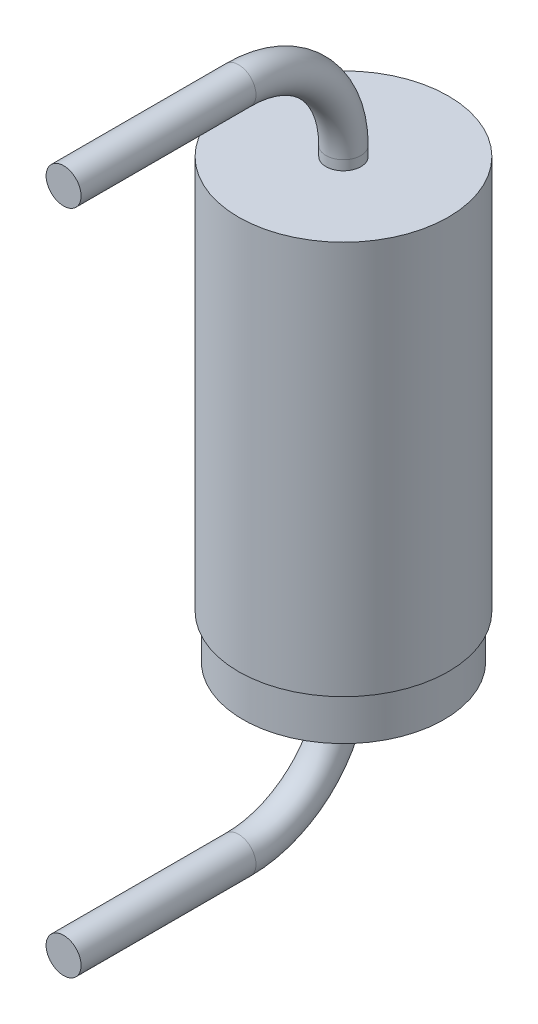
ISO-10303-21;
HEADER;
FILE_DESCRIPTION(('STEP AP214'),'2;1');
FILE_NAME('part.step','',(''),(''),'','','');
FILE_SCHEMA(('AUTOMOTIVE_DESIGN { 1 0 10303 214 1 1 1 1 }'));
ENDSEC;
DATA;
#1=APPLICATION_CONTEXT('core data for automotive mechanical design processes');
#2=APPLICATION_PROTOCOL_DEFINITION('international standard','automotive_design',2000,#1);
#3=PRODUCT_CONTEXT('',#1,'mechanical');
#4=PRODUCT('Part','Part','',(#3));
#5=PRODUCT_RELATED_PRODUCT_CATEGORY('part','',(#4));
#6=PRODUCT_DEFINITION_FORMATION('','',#4);
#7=PRODUCT_DEFINITION_CONTEXT('part definition',#1,'design');
#8=PRODUCT_DEFINITION('design','',#6,#7);
#9=PRODUCT_DEFINITION_SHAPE('','',#8);
#10=(LENGTH_UNIT() NAMED_UNIT(*) SI_UNIT(.MILLI.,.METRE.));
#11=(NAMED_UNIT(*) PLANE_ANGLE_UNIT() SI_UNIT($,.RADIAN.));
#12=(NAMED_UNIT(*) SI_UNIT($,.STERADIAN.) SOLID_ANGLE_UNIT());
#13=UNCERTAINTY_MEASURE_WITH_UNIT(LENGTH_MEASURE(1.E-05),#10,'distance_accuracy_value','');
#14=(GEOMETRIC_REPRESENTATION_CONTEXT(3) GLOBAL_UNCERTAINTY_ASSIGNED_CONTEXT((#13)) GLOBAL_UNIT_ASSIGNED_CONTEXT((#10,
#11,#12)) REPRESENTATION_CONTEXT('',''));
#15=CARTESIAN_POINT('',(0.,0.,0.));
#16=DIRECTION('',(0.,0.,1.));
#17=DIRECTION('',(1.,0.,0.));
#18=AXIS2_PLACEMENT_3D('',#15,#16,#17);
#19=CARTESIAN_POINT('',(0.,-2.5,0.));
#20=DIRECTION('',(0.,1.,0.));
#21=DIRECTION('',(0.,0.,1.));
#22=AXIS2_PLACEMENT_3D('',#19,#20,#21);
#23=CYLINDRICAL_SURFACE('',#22,1.2);
#24=CARTESIAN_POINT('',(0.,2.5,0.));
#25=DIRECTION('',(0.,1.,0.));
#26=DIRECTION('',(0.,0.,1.));
#27=AXIS2_PLACEMENT_3D('',#24,#25,#26);
#28=CIRCLE('',#27,1.2);
#29=CARTESIAN_POINT('',(0.,2.5,1.2));
#30=VERTEX_POINT('',#29);
#31=EDGE_CURVE('E11',#30,#30,#28,.T.);
#32=ORIENTED_EDGE('',*,*,#31,.F.);
#33=EDGE_LOOP('',(#32));
#34=FACE_BOUND('',#33,.T.);
#35=CARTESIAN_POINT('',(0.,-2.,0.));
#36=DIRECTION('',(0.,-1.,0.));
#37=DIRECTION('',(0.,0.,-1.));
#38=AXIS2_PLACEMENT_3D('',#35,#36,#37);
#39=CIRCLE('',#38,1.2);
#40=CARTESIAN_POINT('',(0.,-2.,-1.2));
#41=VERTEX_POINT('',#40);
#42=EDGE_CURVE('E117',#41,#41,#39,.T.);
#43=ORIENTED_EDGE('',*,*,#42,.F.);
#44=EDGE_LOOP('',(#43));
#45=FACE_BOUND('',#44,.T.);
#46=ADVANCED_FACE('F74',(#34,#45),#23,.T.);
#47=CARTESIAN_POINT('',(0.,2.5,0.));
#48=DIRECTION('',(0.,1.,0.));
#49=DIRECTION('',(0.,0.,1.));
#50=AXIS2_PLACEMENT_3D('',#47,#48,#49);
#51=PLANE('',#50);
#52=CARTESIAN_POINT('',(0.,2.5,0.));
#53=DIRECTION('',(0.,-1.,0.));
#54=DIRECTION('',(0.,0.,-1.));
#55=AXIS2_PLACEMENT_3D('',#52,#53,#54);
#56=CIRCLE('',#55,0.2);
#57=CARTESIAN_POINT('',(0.,2.5,-0.2));
#58=VERTEX_POINT('',#57);
#59=EDGE_CURVE('E97',#58,#58,#56,.T.);
#60=ORIENTED_EDGE('',*,*,#59,.T.);
#61=EDGE_LOOP('',(#60));
#62=FACE_BOUND('',#61,.T.);
#63=ORIENTED_EDGE('',*,*,#31,.T.);
#64=EDGE_LOOP('',(#63));
#65=FACE_BOUND('',#64,.T.);
#66=ADVANCED_FACE('F142',(#62,#65),#51,.T.);
#67=CARTESIAN_POINT('',(0.,3.81,3.2));
#68=DIRECTION('',(0.,0.,-1.));
#69=DIRECTION('',(0.,1.,0.));
#70=AXIS2_PLACEMENT_3D('',#67,#68,#69);
#71=PLANE('',#70);
#72=CARTESIAN_POINT('',(0.,3.81,3.2));
#73=DIRECTION('',(0.,0.,-1.));
#74=DIRECTION('',(0.,1.,0.));
#75=AXIS2_PLACEMENT_3D('',#72,#73,#74);
#76=CIRCLE('',#75,0.2);
#77=CARTESIAN_POINT('',(0.,4.01,3.2));
#78=VERTEX_POINT('',#77);
#79=EDGE_CURVE('E81',#78,#78,#76,.T.);
#80=ORIENTED_EDGE('',*,*,#79,.F.);
#81=EDGE_LOOP('',(#80));
#82=FACE_BOUND('',#81,.T.);
#83=ADVANCED_FACE('F138',(#82),#71,.F.);
#84=CARTESIAN_POINT('',(0.,2.5,0.));
#85=DIRECTION('',(0.,1.,0.));
#86=DIRECTION('',(0.,0.,1.));
#87=AXIS2_PLACEMENT_3D('',#84,#85,#86);
#88=CYLINDRICAL_SURFACE('',#87,0.2);
#89=CARTESIAN_POINT('',(0.,2.61,0.));
#90=DIRECTION('',(0.,-1.,0.));
#91=DIRECTION('',(0.,0.,-1.));
#92=AXIS2_PLACEMENT_3D('',#89,#90,#91);
#93=CIRCLE('',#92,0.2);
#94=CARTESIAN_POINT('',(0.,2.61,-0.2));
#95=VERTEX_POINT('',#94);
#96=EDGE_CURVE('E91',#95,#95,#93,.T.);
#97=ORIENTED_EDGE('',*,*,#96,.T.);
#98=EDGE_LOOP('',(#97));
#99=FACE_BOUND('',#98,.T.);
#100=ORIENTED_EDGE('',*,*,#59,.F.);
#101=EDGE_LOOP('',(#100));
#102=FACE_BOUND('',#101,.T.);
#103=ADVANCED_FACE('F153',(#99,#102),#88,.T.);
#104=CARTESIAN_POINT('',(0.,2.61,1.2));
#105=DIRECTION('',(1.,0.,0.));
#106=DIRECTION('',(0.,0.,-1.));
#107=AXIS2_PLACEMENT_3D('',#104,#105,#106);
#108=TOROIDAL_SURFACE('',#107,1.2,0.2);
#109=CARTESIAN_POINT('',(0.,3.81,1.2));
#110=DIRECTION('',(0.,0.,-1.));
#111=DIRECTION('',(0.,1.,0.));
#112=AXIS2_PLACEMENT_3D('',#109,#110,#111);
#113=CIRCLE('',#112,0.2);
#114=CARTESIAN_POINT('',(0.,4.01,1.2));
#115=VERTEX_POINT('',#114);
#116=EDGE_CURVE('E86',#115,#115,#113,.T.);
#117=CARTESIAN_POINT('',(0.,2.61,1.2));
#118=DIRECTION('',(1.,0.,0.));
#119=DIRECTION('',(0.,0.,-1.));
#120=AXIS2_PLACEMENT_3D('',#117,#118,#119);
#121=CIRCLE('',#120,1.4);
#122=EDGE_CURVE('',#95,#115,#121,.T.);
#123=ORIENTED_EDGE('',*,*,#96,.F.);
#124=ORIENTED_EDGE('',*,*,#116,.T.);
#125=ORIENTED_EDGE('',*,*,#122,.T.);
#126=ORIENTED_EDGE('',*,*,#122,.F.);
#127=EDGE_LOOP('',(#123,#125,#124,#126));
#128=FACE_BOUND('',#127,.T.);
#129=ADVANCED_FACE('F157',(#128),#108,.T.);
#130=CARTESIAN_POINT('',(0.,3.81,1.2));
#131=DIRECTION('',(0.,0.,1.));
#132=DIRECTION('',(0.,-1.,0.));
#133=AXIS2_PLACEMENT_3D('',#130,#131,#132);
#134=CYLINDRICAL_SURFACE('',#133,0.2);
#135=ORIENTED_EDGE('',*,*,#79,.T.);
#136=EDGE_LOOP('',(#135));
#137=FACE_BOUND('',#136,.T.);
#138=ORIENTED_EDGE('',*,*,#116,.F.);
#139=EDGE_LOOP('',(#138));
#140=FACE_BOUND('',#139,.T.);
#141=ADVANCED_FACE('F136',(#137,#140),#134,.T.);
#142=CARTESIAN_POINT('',(0.,-2.,0.));
#143=DIRECTION('',(0.,-1.,0.));
#144=DIRECTION('',(0.,0.,-1.));
#145=AXIS2_PLACEMENT_3D('',#142,#143,#144);
#146=PLANE('',#145);
#147=CARTESIAN_POINT('',(0.,-2.,0.));
#148=DIRECTION('',(0.,-1.,0.));
#149=DIRECTION('',(0.,0.,-1.));
#150=AXIS2_PLACEMENT_3D('',#147,#148,#149);
#151=CIRCLE('',#150,1.15);
#152=CARTESIAN_POINT('',(0.,-2.,-1.15));
#153=VERTEX_POINT('',#152);
#154=EDGE_CURVE('E121',#153,#153,#151,.T.);
#155=ORIENTED_EDGE('',*,*,#154,.F.);
#156=EDGE_LOOP('',(#155));
#157=FACE_BOUND('',#156,.T.);
#158=ORIENTED_EDGE('',*,*,#42,.T.);
#159=EDGE_LOOP('',(#158));
#160=FACE_BOUND('',#159,.T.);
#161=ADVANCED_FACE('F133',(#157,#160),#146,.T.);
#162=CARTESIAN_POINT('',(0.,-2.,0.));
#163=DIRECTION('',(0.,-1.,0.));
#164=DIRECTION('',(0.,0.,-1.));
#165=AXIS2_PLACEMENT_3D('',#162,#163,#164);
#166=CYLINDRICAL_SURFACE('',#165,1.15);
#167=ORIENTED_EDGE('',*,*,#154,.T.);
#168=EDGE_LOOP('',(#167));
#169=FACE_BOUND('',#168,.T.);
#170=CARTESIAN_POINT('',(0.,-2.5,0.));
#171=DIRECTION('',(0.,-1.,0.));
#172=DIRECTION('',(0.,0.,-1.));
#173=AXIS2_PLACEMENT_3D('',#170,#171,#172);
#174=CIRCLE('',#173,1.15);
#175=CARTESIAN_POINT('',(0.,-2.5,-1.15));
#176=VERTEX_POINT('',#175);
#177=EDGE_CURVE('E122',#176,#176,#174,.T.);
#178=ORIENTED_EDGE('',*,*,#177,.F.);
#179=EDGE_LOOP('',(#178));
#180=FACE_BOUND('',#179,.T.);
#181=ADVANCED_FACE('F130',(#169,#180),#166,.T.);
#182=CARTESIAN_POINT('',(0.,-3.81,3.2));
#183=DIRECTION('',(0.,0.,-1.));
#184=DIRECTION('',(0.,-1.,0.));
#185=AXIS2_PLACEMENT_3D('',#182,#183,#184);
#186=PLANE('',#185);
#187=CARTESIAN_POINT('',(0.,-3.81,3.2));
#188=DIRECTION('',(0.,0.,1.));
#189=DIRECTION('',(0.,-1.,0.));
#190=AXIS2_PLACEMENT_3D('',#187,#188,#189);
#191=CIRCLE('',#190,0.2);
#192=CARTESIAN_POINT('',(0.,-4.01,3.2));
#193=VERTEX_POINT('',#192);
#194=EDGE_CURVE('E101',#193,#193,#191,.F.);
#195=ORIENTED_EDGE('',*,*,#194,.F.);
#196=EDGE_LOOP('',(#195));
#197=FACE_BOUND('',#196,.T.);
#198=ADVANCED_FACE('F170',(#197),#186,.F.);
#199=CARTESIAN_POINT('',(0.,-3.81,1.2));
#200=DIRECTION('',(0.,0.,1.));
#201=DIRECTION('',(0.,-1.,0.));
#202=AXIS2_PLACEMENT_3D('',#199,#200,#201);
#203=CYLINDRICAL_SURFACE('',#202,0.2);
#204=ORIENTED_EDGE('',*,*,#194,.T.);
#205=EDGE_LOOP('',(#204));
#206=FACE_BOUND('',#205,.T.);
#207=CARTESIAN_POINT('',(0.,-3.81,1.2));
#208=DIRECTION('',(0.,0.,1.));
#209=DIRECTION('',(0.,-1.,0.));
#210=AXIS2_PLACEMENT_3D('',#207,#208,#209);
#211=CIRCLE('',#210,0.2);
#212=CARTESIAN_POINT('',(0.,-4.01,1.2));
#213=VERTEX_POINT('',#212);
#214=EDGE_CURVE('E105',#213,#213,#211,.F.);
#215=ORIENTED_EDGE('',*,*,#214,.F.);
#216=EDGE_LOOP('',(#215));
#217=FACE_BOUND('',#216,.T.);
#218=ADVANCED_FACE('F172',(#206,#217),#203,.T.);
#219=CARTESIAN_POINT('',(0.,-2.61,1.2));
#220=DIRECTION('',(-1.,0.,0.));
#221=DIRECTION('',(0.,0.,1.));
#222=AXIS2_PLACEMENT_3D('',#219,#220,#221);
#223=TOROIDAL_SURFACE('',#222,1.2,0.2);
#224=CARTESIAN_POINT('',(0.,-2.61,0.));
#225=DIRECTION('',(0.,-1.,0.));
#226=DIRECTION('',(0.,0.,-1.));
#227=AXIS2_PLACEMENT_3D('',#224,#225,#226);
#228=CIRCLE('',#227,0.2);
#229=CARTESIAN_POINT('',(0.,-2.61,-0.2));
#230=VERTEX_POINT('',#229);
#231=EDGE_CURVE('E109',#230,#230,#228,.F.);
#232=CARTESIAN_POINT('',(0.,-2.61,1.2));
#233=DIRECTION('',(-1.,0.,0.));
#234=DIRECTION('',(0.,0.,1.));
#235=AXIS2_PLACEMENT_3D('',#232,#233,#234);
#236=CIRCLE('',#235,1.4);
#237=EDGE_CURVE('',#230,#213,#236,.T.);
#238=ORIENTED_EDGE('',*,*,#231,.F.);
#239=ORIENTED_EDGE('',*,*,#214,.T.);
#240=ORIENTED_EDGE('',*,*,#237,.T.);
#241=ORIENTED_EDGE('',*,*,#237,.F.);
#242=EDGE_LOOP('',(#238,#240,#239,#241));
#243=FACE_BOUND('',#242,.T.);
#244=ADVANCED_FACE('F175',(#243),#223,.T.);
#245=CARTESIAN_POINT('',(0.,-2.5,0.));
#246=DIRECTION('',(0.,-1.,0.));
#247=DIRECTION('',(0.,0.,-1.));
#248=AXIS2_PLACEMENT_3D('',#245,#246,#247);
#249=CYLINDRICAL_SURFACE('',#248,0.2);
#250=ORIENTED_EDGE('',*,*,#231,.T.);
#251=EDGE_LOOP('',(#250));
#252=FACE_BOUND('',#251,.T.);
#253=CARTESIAN_POINT('',(0.,-2.5,0.));
#254=DIRECTION('',(0.,-1.,0.));
#255=DIRECTION('',(0.,0.,-1.));
#256=AXIS2_PLACEMENT_3D('',#253,#254,#255);
#257=CIRCLE('',#256,0.2);
#258=CARTESIAN_POINT('',(0.,-2.5,-0.2));
#259=VERTEX_POINT('',#258);
#260=EDGE_CURVE('E113',#259,#259,#257,.F.);
#261=ORIENTED_EDGE('',*,*,#260,.F.);
#262=EDGE_LOOP('',(#261));
#263=FACE_BOUND('',#262,.T.);
#264=ADVANCED_FACE('F179',(#252,#263),#249,.T.);
#265=CARTESIAN_POINT('',(0.,-2.5,0.));
#266=DIRECTION('',(0.,1.,0.));
#267=DIRECTION('',(0.,0.,1.));
#268=AXIS2_PLACEMENT_3D('',#265,#266,#267);
#269=PLANE('',#268);
#270=ORIENTED_EDGE('',*,*,#260,.T.);
#271=EDGE_LOOP('',(#270));
#272=FACE_BOUND('',#271,.T.);
#273=ORIENTED_EDGE('',*,*,#177,.T.);
#274=EDGE_LOOP('',(#273));
#275=FACE_BOUND('',#274,.T.);
#276=ADVANCED_FACE('F182',(#272,#275),#269,.F.);
#277=CLOSED_SHELL('',(#46,#66,#83,#103,#129,#141,#161,#181,#198,#218,#244,#264,#276));
#278=MANIFOLD_SOLID_BREP('B2',#277);
#279=ADVANCED_BREP_SHAPE_REPRESENTATION('',(#18,#278),#14);
#280=SHAPE_DEFINITION_REPRESENTATION(#9,#279);
ENDSEC;
END-ISO-10303-21;
